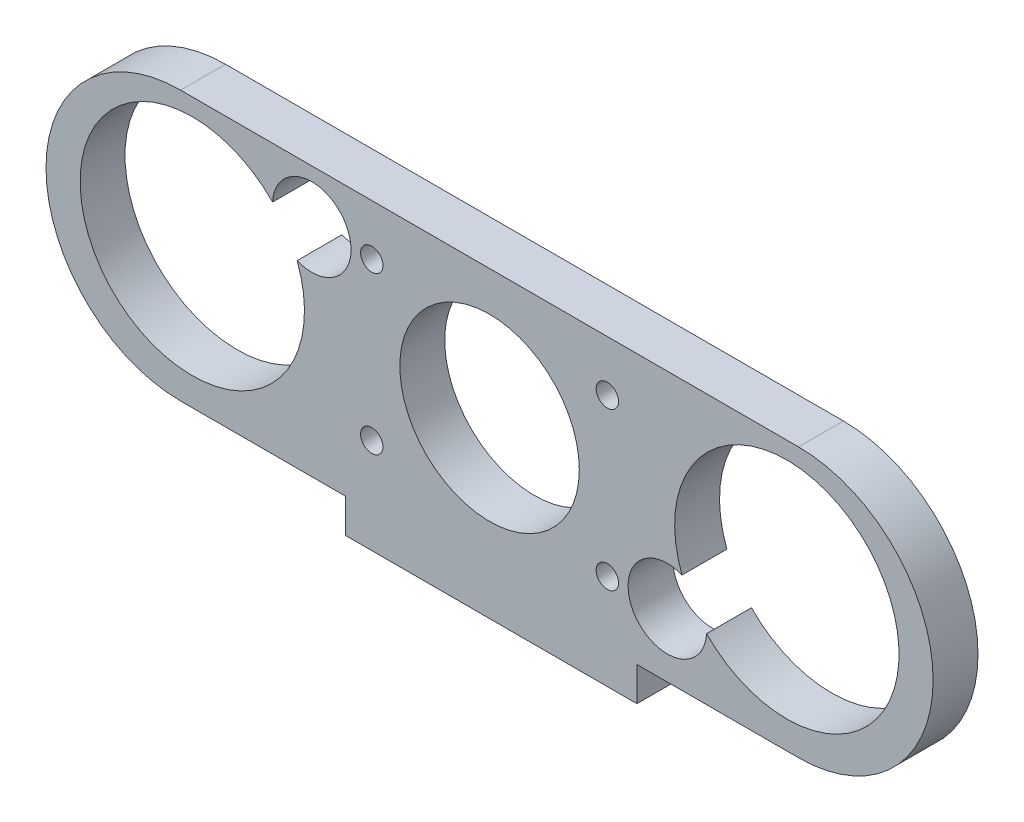
ISO-10303-21;
HEADER;
FILE_DESCRIPTION(('STEP AP214'),'2;1');
FILE_NAME('part.step','',(''),(''),'','','');
FILE_SCHEMA(('AUTOMOTIVE_DESIGN { 1 0 10303 214 1 1 1 1 }'));
ENDSEC;
DATA;
#1=APPLICATION_CONTEXT('core data for automotive mechanical design processes');
#2=APPLICATION_PROTOCOL_DEFINITION('international standard','automotive_design',2000,#1);
#3=PRODUCT_CONTEXT('',#1,'mechanical');
#4=PRODUCT('Part','Part','',(#3));
#5=PRODUCT_RELATED_PRODUCT_CATEGORY('part','',(#4));
#6=PRODUCT_DEFINITION_FORMATION('','',#4);
#7=PRODUCT_DEFINITION_CONTEXT('part definition',#1,'design');
#8=PRODUCT_DEFINITION('design','',#6,#7);
#9=PRODUCT_DEFINITION_SHAPE('','',#8);
#10=(LENGTH_UNIT() NAMED_UNIT(*) SI_UNIT(.MILLI.,.METRE.));
#11=(NAMED_UNIT(*) PLANE_ANGLE_UNIT() SI_UNIT($,.RADIAN.));
#12=(NAMED_UNIT(*) SI_UNIT($,.STERADIAN.) SOLID_ANGLE_UNIT());
#13=UNCERTAINTY_MEASURE_WITH_UNIT(LENGTH_MEASURE(1.E-05),#10,'distance_accuracy_value','');
#14=(GEOMETRIC_REPRESENTATION_CONTEXT(3) GLOBAL_UNCERTAINTY_ASSIGNED_CONTEXT((#13)) GLOBAL_UNIT_ASSIGNED_CONTEXT((#10,
#11,#12)) REPRESENTATION_CONTEXT('',''));
#15=CARTESIAN_POINT('',(0.,0.,0.));
#16=DIRECTION('',(0.,0.,1.));
#17=DIRECTION('',(1.,0.,0.));
#18=AXIS2_PLACEMENT_3D('',#15,#16,#17);
#19=CARTESIAN_POINT('',(-18.5679703226608,15.3790598626723,4.));
#20=DIRECTION('',(0.,0.,1.));
#21=DIRECTION('',(1.,0.,0.));
#22=AXIS2_PLACEMENT_3D('',#19,#20,#21);
#23=PLANE('',#22);
#24=CARTESIAN_POINT('',(19.4736488341297,8.85101887852848,4.));
#25=DIRECTION('',(0.,0.,1.));
#26=DIRECTION('',(1.,0.,0.));
#27=AXIS2_PLACEMENT_3D('',#24,#25,#26);
#28=CIRCLE('',#27,1.);
#29=CARTESIAN_POINT('',(20.4736488341297,8.85101887852848,4.));
#30=VERTEX_POINT('',#29);
#31=EDGE_CURVE('E328',#30,#30,#28,.T.);
#32=ORIENTED_EDGE('',*,*,#31,.F.);
#33=EDGE_LOOP('',(#32));
#34=FACE_BOUND('',#33,.T.);
#35=CARTESIAN_POINT('',(19.4736488341297,22.8510188785285,4.));
#36=DIRECTION('',(0.,0.,1.));
#37=DIRECTION('',(1.,0.,0.));
#38=AXIS2_PLACEMENT_3D('',#35,#36,#37);
#39=CIRCLE('',#38,1.);
#40=CARTESIAN_POINT('',(20.4736488341297,22.8510188785285,4.));
#41=VERTEX_POINT('',#40);
#42=EDGE_CURVE('E340',#41,#41,#39,.T.);
#43=ORIENTED_EDGE('',*,*,#42,.F.);
#44=EDGE_LOOP('',(#43));
#45=FACE_BOUND('',#44,.T.);
#46=CARTESIAN_POINT('',(35.4736488341297,15.8510188785285,4.));
#47=DIRECTION('',(0.,0.,1.));
#48=DIRECTION('',(1.,0.,0.));
#49=AXIS2_PLACEMENT_3D('',#46,#47,#48);
#50=CIRCLE('',#49,10.);
#51=CARTESIAN_POINT('',(28.3184013363334,8.8651450430459,4.));
#52=VERTEX_POINT('',#51);
#53=CARTESIAN_POINT('',(26.1289639540748,12.2905604119158,4.));
#54=VERTEX_POINT('',#53);
#55=EDGE_CURVE('E121',#52,#54,#50,.T.);
#56=ORIENTED_EDGE('',*,*,#55,.F.);
#57=CARTESIAN_POINT('',(24.8229415451076,9.04336077726519,4.));
#58=DIRECTION('',(0.,0.,1.));
#59=DIRECTION('',(1.,0.,0.));
#60=AXIS2_PLACEMENT_3D('',#57,#58,#59);
#61=CIRCLE('',#60,3.5);
#62=EDGE_CURVE('E127',#54,#52,#61,.T.);
#63=ORIENTED_EDGE('',*,*,#62,.F.);
#64=EDGE_LOOP('',(#56,#63));
#65=FACE_BOUND('',#64,.T.);
#66=CARTESIAN_POINT('',(-17.5263511658703,15.8510188785285,4.));
#67=DIRECTION('',(0.,0.,1.));
#68=DIRECTION('',(1.,0.,0.));
#69=AXIS2_PLACEMENT_3D('',#66,#67,#68);
#70=CIRCLE('',#69,10.);
#71=CARTESIAN_POINT('',(-10.371103668074,22.8368927140111,4.));
#72=VERTEX_POINT('',#71);
#73=CARTESIAN_POINT('',(-8.18166628581541,19.4114773451411,4.));
#74=VERTEX_POINT('',#73);
#75=EDGE_CURVE('E146',#72,#74,#70,.T.);
#76=ORIENTED_EDGE('',*,*,#75,.F.);
#77=CARTESIAN_POINT('',(-6.87564387684818,22.6586769797918,4.));
#78=DIRECTION('',(0.,0.,1.));
#79=DIRECTION('',(1.,0.,0.));
#80=AXIS2_PLACEMENT_3D('',#77,#78,#79);
#81=CIRCLE('',#80,3.5);
#82=EDGE_CURVE('E143',#74,#72,#81,.T.);
#83=ORIENTED_EDGE('',*,*,#82,.F.);
#84=EDGE_LOOP('',(#76,#83));
#85=FACE_BOUND('',#84,.T.);
#86=CARTESIAN_POINT('',(-18.5679703226608,15.3790598626723,4.));
#87=DIRECTION('',(0.,0.,1.));
#88=DIRECTION('',(1.,0.,0.));
#89=AXIS2_PLACEMENT_3D('',#86,#87,#88);
#90=CIRCLE('',#89,12.);
#91=CARTESIAN_POINT('',(-18.5679703226608,27.3790598626723,4.));
#92=VERTEX_POINT('',#91);
#93=CARTESIAN_POINT('',(-18.5679703226608,3.37905986267225,4.));
#94=VERTEX_POINT('',#93);
#95=EDGE_CURVE('E160',#92,#94,#90,.T.);
#96=ORIENTED_EDGE('',*,*,#95,.T.);
#97=DIRECTION('',(1.,0.,0.));
#98=VECTOR('',#97,1.);
#99=CARTESIAN_POINT('',(-3.88985087447617,3.37905986267225,4.));
#100=LINE('',#99,#98);
#101=CARTESIAN_POINT('',(-3.88985087447617,3.37905986267225,4.));
#102=VERTEX_POINT('',#101);
#103=EDGE_CURVE('E163',#94,#102,#100,.T.);
#104=ORIENTED_EDGE('',*,*,#103,.T.);
#105=DIRECTION('',(0.,-1.,0.));
#106=VECTOR('',#105,1.);
#107=CARTESIAN_POINT('',(-3.88985087447617,3.37905986267225,4.));
#108=LINE('',#107,#106);
#109=CARTESIAN_POINT('',(-3.88985087447617,0.351018878528479,4.));
#110=VERTEX_POINT('',#109);
#111=EDGE_CURVE('E166',#102,#110,#108,.T.);
#112=ORIENTED_EDGE('',*,*,#111,.T.);
#113=DIRECTION('',(1.,0.,0.));
#114=VECTOR('',#113,1.);
#115=CARTESIAN_POINT('',(-3.88985087447617,0.351018878528479,4.));
#116=LINE('',#115,#114);
#117=CARTESIAN_POINT('',(22.1101491255238,0.351018878528479,4.));
#118=VERTEX_POINT('',#117);
#119=EDGE_CURVE('E168',#110,#118,#116,.T.);
#120=ORIENTED_EDGE('',*,*,#119,.T.);
#121=DIRECTION('',(0.,1.,0.));
#122=VECTOR('',#121,1.);
#123=CARTESIAN_POINT('',(22.1101491255238,0.351018878528479,4.));
#124=LINE('',#123,#122);
#125=CARTESIAN_POINT('',(22.1101491255238,3.37905986267225,4.));
#126=VERTEX_POINT('',#125);
#127=EDGE_CURVE('E170',#118,#126,#124,.T.);
#128=ORIENTED_EDGE('',*,*,#127,.T.);
#129=DIRECTION('',(1.,0.,0.));
#130=VECTOR('',#129,1.);
#131=CARTESIAN_POINT('',(36.5152679909201,3.37905986267225,4.));
#132=LINE('',#131,#130);
#133=CARTESIAN_POINT('',(36.5152679909201,3.37905986267225,4.));
#134=VERTEX_POINT('',#133);
#135=EDGE_CURVE('E172',#126,#134,#132,.T.);
#136=ORIENTED_EDGE('',*,*,#135,.T.);
#137=CARTESIAN_POINT('',(36.5152679909201,15.3790598626723,4.));
#138=DIRECTION('',(0.,0.,1.));
#139=DIRECTION('',(-1.,0.,0.));
#140=AXIS2_PLACEMENT_3D('',#137,#138,#139);
#141=CIRCLE('',#140,12.);
#142=CARTESIAN_POINT('',(36.5152679909201,27.3790598626723,4.));
#143=VERTEX_POINT('',#142);
#144=EDGE_CURVE('E174',#134,#143,#141,.T.);
#145=ORIENTED_EDGE('',*,*,#144,.T.);
#146=DIRECTION('',(-1.,0.,0.));
#147=VECTOR('',#146,1.);
#148=CARTESIAN_POINT('',(-18.5679703226608,27.3790598626723,4.));
#149=LINE('',#148,#147);
#150=EDGE_CURVE('E176',#143,#92,#149,.T.);
#151=ORIENTED_EDGE('',*,*,#150,.T.);
#152=EDGE_LOOP('',(#96,#104,#112,#120,#128,#136,#145,#151));
#153=FACE_BOUND('',#152,.T.);
#154=CARTESIAN_POINT('',(-1.52635116587031,22.8510188785285,4.));
#155=DIRECTION('',(0.,0.,1.));
#156=DIRECTION('',(1.,0.,0.));
#157=AXIS2_PLACEMENT_3D('',#154,#155,#156);
#158=CIRCLE('',#157,1.);
#159=CARTESIAN_POINT('',(-0.526351165870305,22.8510188785285,4.));
#160=VERTEX_POINT('',#159);
#161=EDGE_CURVE('E139',#160,#160,#158,.T.);
#162=ORIENTED_EDGE('',*,*,#161,.F.);
#163=EDGE_LOOP('',(#162));
#164=FACE_BOUND('',#163,.T.);
#165=CARTESIAN_POINT('',(-1.52635116587031,8.85101887852847,4.));
#166=DIRECTION('',(0.,0.,1.));
#167=DIRECTION('',(1.,0.,0.));
#168=AXIS2_PLACEMENT_3D('',#165,#166,#167);
#169=CIRCLE('',#168,1.);
#170=CARTESIAN_POINT('',(-0.526351165870306,8.85101887852847,4.));
#171=VERTEX_POINT('',#170);
#172=EDGE_CURVE('E334',#171,#171,#169,.T.);
#173=ORIENTED_EDGE('',*,*,#172,.F.);
#174=EDGE_LOOP('',(#173));
#175=FACE_BOUND('',#174,.T.);
#176=CARTESIAN_POINT('',(8.97364883412969,15.8510188785285,4.));
#177=DIRECTION('',(0.,0.,1.));
#178=DIRECTION('',(1.,0.,0.));
#179=AXIS2_PLACEMENT_3D('',#176,#177,#178);
#180=CIRCLE('',#179,8.);
#181=CARTESIAN_POINT('',(16.9736488341297,15.8510188785285,4.));
#182=VERTEX_POINT('',#181);
#183=EDGE_CURVE('E319',#182,#182,#180,.T.);
#184=ORIENTED_EDGE('',*,*,#183,.F.);
#185=EDGE_LOOP('',(#184));
#186=FACE_BOUND('',#185,.T.);
#187=ADVANCED_FACE('F33',(#34,#45,#65,#85,#153,#164,#175,#186),#23,.T.);
#188=CARTESIAN_POINT('',(-18.5679703226608,15.3790598626723,0.));
#189=DIRECTION('',(0.,0.,1.));
#190=DIRECTION('',(1.,0.,0.));
#191=AXIS2_PLACEMENT_3D('',#188,#189,#190);
#192=PLANE('',#191);
#193=CARTESIAN_POINT('',(-6.87564387684818,22.6586769797918,0.));
#194=DIRECTION('',(0.,0.,1.));
#195=DIRECTION('',(1.,0.,0.));
#196=AXIS2_PLACEMENT_3D('',#193,#194,#195);
#197=CIRCLE('',#196,3.5);
#198=CARTESIAN_POINT('',(-8.18166628581541,19.4114773451411,0.));
#199=VERTEX_POINT('',#198);
#200=CARTESIAN_POINT('',(-10.371103668074,22.8368927140111,0.));
#201=VERTEX_POINT('',#200);
#202=EDGE_CURVE('E142',#199,#201,#197,.T.);
#203=ORIENTED_EDGE('',*,*,#202,.T.);
#204=CARTESIAN_POINT('',(-17.5263511658703,15.8510188785285,0.));
#205=DIRECTION('',(0.,0.,1.));
#206=DIRECTION('',(1.,0.,0.));
#207=AXIS2_PLACEMENT_3D('',#204,#205,#206);
#208=CIRCLE('',#207,10.);
#209=EDGE_CURVE('E147',#201,#199,#208,.T.);
#210=ORIENTED_EDGE('',*,*,#209,.T.);
#211=EDGE_LOOP('',(#203,#210));
#212=FACE_BOUND('',#211,.T.);
#213=CARTESIAN_POINT('',(-18.5679703226608,15.3790598626723,0.));
#214=DIRECTION('',(0.,0.,1.));
#215=DIRECTION('',(1.,0.,0.));
#216=AXIS2_PLACEMENT_3D('',#213,#214,#215);
#217=CIRCLE('',#216,12.);
#218=CARTESIAN_POINT('',(-18.5679703226608,27.3790598626723,0.));
#219=VERTEX_POINT('',#218);
#220=CARTESIAN_POINT('',(-18.5679703226608,3.37905986267225,0.));
#221=VERTEX_POINT('',#220);
#222=EDGE_CURVE('E159',#219,#221,#217,.T.);
#223=ORIENTED_EDGE('',*,*,#222,.F.);
#224=DIRECTION('',(-1.,0.,0.));
#225=VECTOR('',#224,1.);
#226=CARTESIAN_POINT('',(-18.5679703226608,27.3790598626723,0.));
#227=LINE('',#226,#225);
#228=CARTESIAN_POINT('',(36.5152679909201,27.3790598626723,0.));
#229=VERTEX_POINT('',#228);
#230=EDGE_CURVE('E164',#229,#219,#227,.T.);
#231=ORIENTED_EDGE('',*,*,#230,.F.);
#232=CARTESIAN_POINT('',(36.5152679909201,15.3790598626723,0.));
#233=DIRECTION('',(0.,0.,1.));
#234=DIRECTION('',(-1.,0.,0.));
#235=AXIS2_PLACEMENT_3D('',#232,#233,#234);
#236=CIRCLE('',#235,12.);
#237=CARTESIAN_POINT('',(36.5152679909201,3.37905986267225,0.));
#238=VERTEX_POINT('',#237);
#239=EDGE_CURVE('E191',#238,#229,#236,.T.);
#240=ORIENTED_EDGE('',*,*,#239,.F.);
#241=DIRECTION('',(1.,0.,0.));
#242=VECTOR('',#241,1.);
#243=CARTESIAN_POINT('',(36.5152679909201,3.37905986267225,0.));
#244=LINE('',#243,#242);
#245=CARTESIAN_POINT('',(22.1101491255238,3.37905986267225,0.));
#246=VERTEX_POINT('',#245);
#247=EDGE_CURVE('E189',#246,#238,#244,.T.);
#248=ORIENTED_EDGE('',*,*,#247,.F.);
#249=DIRECTION('',(0.,1.,0.));
#250=VECTOR('',#249,1.);
#251=CARTESIAN_POINT('',(22.1101491255238,0.351018878528479,0.));
#252=LINE('',#251,#250);
#253=CARTESIAN_POINT('',(22.1101491255238,0.351018878528479,0.));
#254=VERTEX_POINT('',#253);
#255=EDGE_CURVE('E187',#254,#246,#252,.T.);
#256=ORIENTED_EDGE('',*,*,#255,.F.);
#257=DIRECTION('',(1.,0.,0.));
#258=VECTOR('',#257,1.);
#259=CARTESIAN_POINT('',(-3.88985087447617,0.351018878528479,0.));
#260=LINE('',#259,#258);
#261=CARTESIAN_POINT('',(-3.88985087447617,0.351018878528479,0.));
#262=VERTEX_POINT('',#261);
#263=EDGE_CURVE('E185',#262,#254,#260,.T.);
#264=ORIENTED_EDGE('',*,*,#263,.F.);
#265=DIRECTION('',(0.,-1.,0.));
#266=VECTOR('',#265,1.);
#267=CARTESIAN_POINT('',(-3.88985087447617,3.37905986267225,0.));
#268=LINE('',#267,#266);
#269=CARTESIAN_POINT('',(-3.88985087447617,3.37905986267225,0.));
#270=VERTEX_POINT('',#269);
#271=EDGE_CURVE('E183',#270,#262,#268,.T.);
#272=ORIENTED_EDGE('',*,*,#271,.F.);
#273=DIRECTION('',(1.,0.,0.));
#274=VECTOR('',#273,1.);
#275=CARTESIAN_POINT('',(-3.88985087447617,3.37905986267225,0.));
#276=LINE('',#275,#274);
#277=EDGE_CURVE('E181',#221,#270,#276,.T.);
#278=ORIENTED_EDGE('',*,*,#277,.F.);
#279=EDGE_LOOP('',(#223,#231,#240,#248,#256,#264,#272,#278));
#280=FACE_BOUND('',#279,.T.);
#281=CARTESIAN_POINT('',(24.8229415451076,9.04336077726519,0.));
#282=DIRECTION('',(0.,0.,1.));
#283=DIRECTION('',(1.,0.,0.));
#284=AXIS2_PLACEMENT_3D('',#281,#282,#283);
#285=CIRCLE('',#284,3.5);
#286=CARTESIAN_POINT('',(26.1289639540748,12.2905604119158,0.));
#287=VERTEX_POINT('',#286);
#288=CARTESIAN_POINT('',(28.3184013363334,8.8651450430459,0.));
#289=VERTEX_POINT('',#288);
#290=EDGE_CURVE('E55',#287,#289,#285,.T.);
#291=ORIENTED_EDGE('',*,*,#290,.T.);
#292=CARTESIAN_POINT('',(35.4736488341297,15.8510188785285,0.));
#293=DIRECTION('',(0.,0.,1.));
#294=DIRECTION('',(1.,0.,0.));
#295=AXIS2_PLACEMENT_3D('',#292,#293,#294);
#296=CIRCLE('',#295,10.);
#297=EDGE_CURVE('E132',#289,#287,#296,.T.);
#298=ORIENTED_EDGE('',*,*,#297,.T.);
#299=EDGE_LOOP('',(#291,#298));
#300=FACE_BOUND('',#299,.T.);
#301=CARTESIAN_POINT('',(-1.52635116587031,22.8510188785285,0.));
#302=DIRECTION('',(0.,0.,1.));
#303=DIRECTION('',(1.,0.,0.));
#304=AXIS2_PLACEMENT_3D('',#301,#302,#303);
#305=CIRCLE('',#304,1.);
#306=CARTESIAN_POINT('',(-0.526351165870305,22.8510188785285,0.));
#307=VERTEX_POINT('',#306);
#308=EDGE_CURVE('E136',#307,#307,#305,.T.);
#309=ORIENTED_EDGE('',*,*,#308,.T.);
#310=EDGE_LOOP('',(#309));
#311=FACE_BOUND('',#310,.T.);
#312=CARTESIAN_POINT('',(19.4736488341297,22.8510188785285,0.));
#313=DIRECTION('',(0.,0.,1.));
#314=DIRECTION('',(1.,0.,0.));
#315=AXIS2_PLACEMENT_3D('',#312,#313,#314);
#316=CIRCLE('',#315,1.);
#317=CARTESIAN_POINT('',(20.4736488341297,22.8510188785285,0.));
#318=VERTEX_POINT('',#317);
#319=EDGE_CURVE('E337',#318,#318,#316,.T.);
#320=ORIENTED_EDGE('',*,*,#319,.T.);
#321=EDGE_LOOP('',(#320));
#322=FACE_BOUND('',#321,.T.);
#323=CARTESIAN_POINT('',(-1.52635116587031,8.85101887852847,0.));
#324=DIRECTION('',(0.,0.,1.));
#325=DIRECTION('',(1.,0.,0.));
#326=AXIS2_PLACEMENT_3D('',#323,#324,#325);
#327=CIRCLE('',#326,1.);
#328=CARTESIAN_POINT('',(-0.526351165870306,8.85101887852847,0.));
#329=VERTEX_POINT('',#328);
#330=EDGE_CURVE('E331',#329,#329,#327,.T.);
#331=ORIENTED_EDGE('',*,*,#330,.T.);
#332=EDGE_LOOP('',(#331));
#333=FACE_BOUND('',#332,.T.);
#334=CARTESIAN_POINT('',(19.4736488341297,8.85101887852848,0.));
#335=DIRECTION('',(0.,0.,1.));
#336=DIRECTION('',(1.,0.,0.));
#337=AXIS2_PLACEMENT_3D('',#334,#335,#336);
#338=CIRCLE('',#337,1.);
#339=CARTESIAN_POINT('',(20.4736488341297,8.85101887852848,0.));
#340=VERTEX_POINT('',#339);
#341=EDGE_CURVE('E325',#340,#340,#338,.T.);
#342=ORIENTED_EDGE('',*,*,#341,.T.);
#343=EDGE_LOOP('',(#342));
#344=FACE_BOUND('',#343,.T.);
#345=CARTESIAN_POINT('',(8.97364883412969,15.8510188785285,0.));
#346=DIRECTION('',(0.,0.,1.));
#347=DIRECTION('',(1.,0.,0.));
#348=AXIS2_PLACEMENT_3D('',#345,#346,#347);
#349=CIRCLE('',#348,8.);
#350=CARTESIAN_POINT('',(16.9736488341297,15.8510188785285,0.));
#351=VERTEX_POINT('',#350);
#352=EDGE_CURVE('E322',#351,#351,#349,.T.);
#353=ORIENTED_EDGE('',*,*,#352,.T.);
#354=EDGE_LOOP('',(#353));
#355=FACE_BOUND('',#354,.T.);
#356=ADVANCED_FACE('F221',(#212,#280,#300,#311,#322,#333,#344,#355),#192,.F.);
#357=CARTESIAN_POINT('',(-18.5679703226608,15.3790598626723,4.));
#358=DIRECTION('',(0.,0.,-1.));
#359=DIRECTION('',(-1.,0.,0.));
#360=AXIS2_PLACEMENT_3D('',#357,#358,#359);
#361=CYLINDRICAL_SURFACE('',#360,12.);
#362=ORIENTED_EDGE('',*,*,#222,.T.);
#363=DIRECTION('',(0.,0.,-1.));
#364=VECTOR('',#363,1.);
#365=CARTESIAN_POINT('',(-18.5679703226608,3.37905986267225,4.));
#366=LINE('',#365,#364);
#367=EDGE_CURVE('E11',#94,#221,#366,.T.);
#368=ORIENTED_EDGE('',*,*,#367,.F.);
#369=ORIENTED_EDGE('',*,*,#95,.F.);
#370=DIRECTION('',(0.,0.,-1.));
#371=VECTOR('',#370,1.);
#372=CARTESIAN_POINT('',(-18.5679703226608,27.3790598626723,4.));
#373=LINE('',#372,#371);
#374=EDGE_CURVE('E178',#92,#219,#373,.T.);
#375=ORIENTED_EDGE('',*,*,#374,.T.);
#376=EDGE_LOOP('',(#362,#368,#369,#375));
#377=FACE_BOUND('',#376,.T.);
#378=ADVANCED_FACE('F35',(#377),#361,.T.);
#379=CARTESIAN_POINT('',(-3.88985087447617,3.37905986267225,4.));
#380=DIRECTION('',(0.,1.,0.));
#381=DIRECTION('',(-1.,0.,0.));
#382=AXIS2_PLACEMENT_3D('',#379,#380,#381);
#383=PLANE('',#382);
#384=ORIENTED_EDGE('',*,*,#277,.T.);
#385=DIRECTION('',(0.,0.,-1.));
#386=VECTOR('',#385,1.);
#387=CARTESIAN_POINT('',(-3.88985087447617,3.37905986267225,4.));
#388=LINE('',#387,#386);
#389=EDGE_CURVE('E41',#102,#270,#388,.T.);
#390=ORIENTED_EDGE('',*,*,#389,.F.);
#391=ORIENTED_EDGE('',*,*,#103,.F.);
#392=ORIENTED_EDGE('',*,*,#367,.T.);
#393=EDGE_LOOP('',(#384,#390,#391,#392));
#394=FACE_BOUND('',#393,.T.);
#395=ADVANCED_FACE('F239',(#394),#383,.F.);
#396=CARTESIAN_POINT('',(-3.88985087447617,3.37905986267225,4.));
#397=DIRECTION('',(1.,0.,0.));
#398=DIRECTION('',(0.,1.,0.));
#399=AXIS2_PLACEMENT_3D('',#396,#397,#398);
#400=PLANE('',#399);
#401=ORIENTED_EDGE('',*,*,#271,.T.);
#402=DIRECTION('',(0.,0.,-1.));
#403=VECTOR('',#402,1.);
#404=CARTESIAN_POINT('',(-3.88985087447617,0.351018878528479,4.));
#405=LINE('',#404,#403);
#406=EDGE_CURVE('E208',#110,#262,#405,.T.);
#407=ORIENTED_EDGE('',*,*,#406,.F.);
#408=ORIENTED_EDGE('',*,*,#111,.F.);
#409=ORIENTED_EDGE('',*,*,#389,.T.);
#410=EDGE_LOOP('',(#401,#407,#408,#409));
#411=FACE_BOUND('',#410,.T.);
#412=ADVANCED_FACE('F215',(#411),#400,.F.);
#413=CARTESIAN_POINT('',(-3.88985087447617,0.351018878528479,4.));
#414=DIRECTION('',(0.,1.,0.));
#415=DIRECTION('',(0.,0.,1.));
#416=AXIS2_PLACEMENT_3D('',#413,#414,#415);
#417=PLANE('',#416);
#418=ORIENTED_EDGE('',*,*,#263,.T.);
#419=DIRECTION('',(0.,0.,-1.));
#420=VECTOR('',#419,1.);
#421=CARTESIAN_POINT('',(22.1101491255238,0.351018878528479,4.));
#422=LINE('',#421,#420);
#423=EDGE_CURVE('E205',#118,#254,#422,.T.);
#424=ORIENTED_EDGE('',*,*,#423,.F.);
#425=ORIENTED_EDGE('',*,*,#119,.F.);
#426=ORIENTED_EDGE('',*,*,#406,.T.);
#427=EDGE_LOOP('',(#418,#424,#425,#426));
#428=FACE_BOUND('',#427,.T.);
#429=ADVANCED_FACE('F227',(#428),#417,.F.);
#430=CARTESIAN_POINT('',(22.1101491255238,0.351018878528479,4.));
#431=DIRECTION('',(-1.,0.,0.));
#432=DIRECTION('',(0.,0.,1.));
#433=AXIS2_PLACEMENT_3D('',#430,#431,#432);
#434=PLANE('',#433);
#435=ORIENTED_EDGE('',*,*,#255,.T.);
#436=DIRECTION('',(0.,0.,-1.));
#437=VECTOR('',#436,1.);
#438=CARTESIAN_POINT('',(22.1101491255238,3.37905986267225,4.));
#439=LINE('',#438,#437);
#440=EDGE_CURVE('E202',#126,#246,#439,.T.);
#441=ORIENTED_EDGE('',*,*,#440,.F.);
#442=ORIENTED_EDGE('',*,*,#127,.F.);
#443=ORIENTED_EDGE('',*,*,#423,.T.);
#444=EDGE_LOOP('',(#435,#441,#442,#443));
#445=FACE_BOUND('',#444,.T.);
#446=ADVANCED_FACE('F231',(#445),#434,.F.);
#447=CARTESIAN_POINT('',(36.5152679909201,3.37905986267225,4.));
#448=DIRECTION('',(0.,1.,0.));
#449=DIRECTION('',(-1.,0.,0.));
#450=AXIS2_PLACEMENT_3D('',#447,#448,#449);
#451=PLANE('',#450);
#452=ORIENTED_EDGE('',*,*,#247,.T.);
#453=DIRECTION('',(0.,0.,-1.));
#454=VECTOR('',#453,1.);
#455=CARTESIAN_POINT('',(36.5152679909201,3.37905986267225,4.));
#456=LINE('',#455,#454);
#457=EDGE_CURVE('E199',#134,#238,#456,.T.);
#458=ORIENTED_EDGE('',*,*,#457,.F.);
#459=ORIENTED_EDGE('',*,*,#135,.F.);
#460=ORIENTED_EDGE('',*,*,#440,.T.);
#461=EDGE_LOOP('',(#452,#458,#459,#460));
#462=FACE_BOUND('',#461,.T.);
#463=ADVANCED_FACE('F252',(#462),#451,.F.);
#464=CARTESIAN_POINT('',(36.5152679909201,15.3790598626723,4.));
#465=DIRECTION('',(0.,0.,-1.));
#466=DIRECTION('',(-1.,0.,0.));
#467=AXIS2_PLACEMENT_3D('',#464,#465,#466);
#468=CYLINDRICAL_SURFACE('',#467,12.);
#469=ORIENTED_EDGE('',*,*,#239,.T.);
#470=DIRECTION('',(0.,0.,-1.));
#471=VECTOR('',#470,1.);
#472=CARTESIAN_POINT('',(36.5152679909201,27.3790598626723,4.));
#473=LINE('',#472,#471);
#474=EDGE_CURVE('E196',#143,#229,#473,.T.);
#475=ORIENTED_EDGE('',*,*,#474,.F.);
#476=ORIENTED_EDGE('',*,*,#144,.F.);
#477=ORIENTED_EDGE('',*,*,#457,.T.);
#478=EDGE_LOOP('',(#469,#475,#476,#477));
#479=FACE_BOUND('',#478,.T.);
#480=ADVANCED_FACE('F250',(#479),#468,.T.);
#481=CARTESIAN_POINT('',(-18.5679703226608,27.3790598626723,4.));
#482=DIRECTION('',(0.,-1.,0.));
#483=DIRECTION('',(0.,0.,-1.));
#484=AXIS2_PLACEMENT_3D('',#481,#482,#483);
#485=PLANE('',#484);
#486=ORIENTED_EDGE('',*,*,#230,.T.);
#487=ORIENTED_EDGE('',*,*,#374,.F.);
#488=ORIENTED_EDGE('',*,*,#150,.F.);
#489=ORIENTED_EDGE('',*,*,#474,.T.);
#490=EDGE_LOOP('',(#486,#487,#488,#489));
#491=FACE_BOUND('',#490,.T.);
#492=ADVANCED_FACE('F245',(#491),#485,.F.);
#493=CARTESIAN_POINT('',(-6.87564387684818,22.6586769797918,4.));
#494=DIRECTION('',(0.,0.,-1.));
#495=DIRECTION('',(-1.,0.,0.));
#496=AXIS2_PLACEMENT_3D('',#493,#494,#495);
#497=CYLINDRICAL_SURFACE('',#496,3.5);
#498=ORIENTED_EDGE('',*,*,#202,.F.);
#499=DIRECTION('',(0.,0.,-1.));
#500=VECTOR('',#499,1.);
#501=CARTESIAN_POINT('',(-8.18166628581541,19.4114773451411,4.));
#502=LINE('',#501,#500);
#503=EDGE_CURVE('E149',#74,#199,#502,.T.);
#504=ORIENTED_EDGE('',*,*,#503,.F.);
#505=ORIENTED_EDGE('',*,*,#82,.T.);
#506=DIRECTION('',(0.,0.,-1.));
#507=VECTOR('',#506,1.);
#508=CARTESIAN_POINT('',(-10.371103668074,22.8368927140111,4.));
#509=LINE('',#508,#507);
#510=EDGE_CURVE('E156',#72,#201,#509,.T.);
#511=ORIENTED_EDGE('',*,*,#510,.T.);
#512=EDGE_LOOP('',(#498,#504,#505,#511));
#513=FACE_BOUND('',#512,.T.);
#514=ADVANCED_FACE('F272',(#513),#497,.F.);
#515=CARTESIAN_POINT('',(-17.5263511658703,15.8510188785285,4.));
#516=DIRECTION('',(0.,0.,-1.));
#517=DIRECTION('',(-1.,0.,0.));
#518=AXIS2_PLACEMENT_3D('',#515,#516,#517);
#519=CYLINDRICAL_SURFACE('',#518,10.);
#520=ORIENTED_EDGE('',*,*,#209,.F.);
#521=ORIENTED_EDGE('',*,*,#510,.F.);
#522=ORIENTED_EDGE('',*,*,#75,.T.);
#523=ORIENTED_EDGE('',*,*,#503,.T.);
#524=EDGE_LOOP('',(#520,#521,#522,#523));
#525=FACE_BOUND('',#524,.T.);
#526=ADVANCED_FACE('F279',(#525),#519,.F.);
#527=CARTESIAN_POINT('',(24.8229415451076,9.04336077726519,4.));
#528=DIRECTION('',(0.,0.,-1.));
#529=DIRECTION('',(-1.,0.,0.));
#530=AXIS2_PLACEMENT_3D('',#527,#528,#529);
#531=CYLINDRICAL_SURFACE('',#530,3.5);
#532=ORIENTED_EDGE('',*,*,#290,.F.);
#533=DIRECTION('',(0.,0.,-1.));
#534=VECTOR('',#533,1.);
#535=CARTESIAN_POINT('',(26.1289639540748,12.2905604119158,4.));
#536=LINE('',#535,#534);
#537=EDGE_CURVE('E123',#54,#287,#536,.T.);
#538=ORIENTED_EDGE('',*,*,#537,.F.);
#539=ORIENTED_EDGE('',*,*,#62,.T.);
#540=DIRECTION('',(0.,0.,-1.));
#541=VECTOR('',#540,1.);
#542=CARTESIAN_POINT('',(28.3184013363334,8.8651450430459,4.));
#543=LINE('',#542,#541);
#544=EDGE_CURVE('E48',#52,#289,#543,.T.);
#545=ORIENTED_EDGE('',*,*,#544,.T.);
#546=EDGE_LOOP('',(#532,#538,#539,#545));
#547=FACE_BOUND('',#546,.T.);
#548=ADVANCED_FACE('F129',(#547),#531,.F.);
#549=CARTESIAN_POINT('',(35.4736488341297,15.8510188785285,4.));
#550=DIRECTION('',(0.,0.,-1.));
#551=DIRECTION('',(-1.,0.,0.));
#552=AXIS2_PLACEMENT_3D('',#549,#550,#551);
#553=CYLINDRICAL_SURFACE('',#552,10.);
#554=ORIENTED_EDGE('',*,*,#297,.F.);
#555=ORIENTED_EDGE('',*,*,#544,.F.);
#556=ORIENTED_EDGE('',*,*,#55,.T.);
#557=ORIENTED_EDGE('',*,*,#537,.T.);
#558=EDGE_LOOP('',(#554,#555,#556,#557));
#559=FACE_BOUND('',#558,.T.);
#560=ADVANCED_FACE('F122',(#559),#553,.F.);
#561=CARTESIAN_POINT('',(-1.52635116587031,22.8510188785285,4.));
#562=DIRECTION('',(0.,0.,-1.));
#563=DIRECTION('',(-1.,0.,0.));
#564=AXIS2_PLACEMENT_3D('',#561,#562,#563);
#565=CYLINDRICAL_SURFACE('',#564,1.);
#566=ORIENTED_EDGE('',*,*,#161,.T.);
#567=EDGE_LOOP('',(#566));
#568=FACE_BOUND('',#567,.T.);
#569=ORIENTED_EDGE('',*,*,#308,.F.);
#570=EDGE_LOOP('',(#569));
#571=FACE_BOUND('',#570,.T.);
#572=ADVANCED_FACE('F295',(#568,#571),#565,.F.);
#573=CARTESIAN_POINT('',(19.4736488341297,22.8510188785285,4.));
#574=DIRECTION('',(0.,0.,-1.));
#575=DIRECTION('',(-1.,0.,0.));
#576=AXIS2_PLACEMENT_3D('',#573,#574,#575);
#577=CYLINDRICAL_SURFACE('',#576,1.);
#578=ORIENTED_EDGE('',*,*,#42,.T.);
#579=EDGE_LOOP('',(#578));
#580=FACE_BOUND('',#579,.T.);
#581=ORIENTED_EDGE('',*,*,#319,.F.);
#582=EDGE_LOOP('',(#581));
#583=FACE_BOUND('',#582,.T.);
#584=ADVANCED_FACE('F298',(#580,#583),#577,.F.);
#585=CARTESIAN_POINT('',(-1.52635116587031,8.85101887852847,4.));
#586=DIRECTION('',(0.,0.,-1.));
#587=DIRECTION('',(-1.,0.,0.));
#588=AXIS2_PLACEMENT_3D('',#585,#586,#587);
#589=CYLINDRICAL_SURFACE('',#588,1.);
#590=ORIENTED_EDGE('',*,*,#172,.T.);
#591=EDGE_LOOP('',(#590));
#592=FACE_BOUND('',#591,.T.);
#593=ORIENTED_EDGE('',*,*,#330,.F.);
#594=EDGE_LOOP('',(#593));
#595=FACE_BOUND('',#594,.T.);
#596=ADVANCED_FACE('F302',(#592,#595),#589,.F.);
#597=CARTESIAN_POINT('',(19.4736488341297,8.85101887852848,4.));
#598=DIRECTION('',(0.,0.,-1.));
#599=DIRECTION('',(-1.,0.,0.));
#600=AXIS2_PLACEMENT_3D('',#597,#598,#599);
#601=CYLINDRICAL_SURFACE('',#600,1.);
#602=ORIENTED_EDGE('',*,*,#31,.T.);
#603=EDGE_LOOP('',(#602));
#604=FACE_BOUND('',#603,.T.);
#605=ORIENTED_EDGE('',*,*,#341,.F.);
#606=EDGE_LOOP('',(#605));
#607=FACE_BOUND('',#606,.T.);
#608=ADVANCED_FACE('F306',(#604,#607),#601,.F.);
#609=CARTESIAN_POINT('',(8.97364883412969,15.8510188785285,4.));
#610=DIRECTION('',(0.,0.,-1.));
#611=DIRECTION('',(-1.,0.,0.));
#612=AXIS2_PLACEMENT_3D('',#609,#610,#611);
#613=CYLINDRICAL_SURFACE('',#612,8.);
#614=ORIENTED_EDGE('',*,*,#183,.T.);
#615=EDGE_LOOP('',(#614));
#616=FACE_BOUND('',#615,.T.);
#617=ORIENTED_EDGE('',*,*,#352,.F.);
#618=EDGE_LOOP('',(#617));
#619=FACE_BOUND('',#618,.T.);
#620=ADVANCED_FACE('F310',(#616,#619),#613,.F.);
#621=CLOSED_SHELL('',(#187,#356,#378,#395,#412,#429,#446,#463,#480,#492,#514,#526,#548,#560,
#572,#584,#596,#608,#620));
#622=MANIFOLD_SOLID_BREP('B2',#621);
#623=ADVANCED_BREP_SHAPE_REPRESENTATION('',(#18,#622),#14);
#624=SHAPE_DEFINITION_REPRESENTATION(#9,#623);
ENDSEC;
END-ISO-10303-21;
